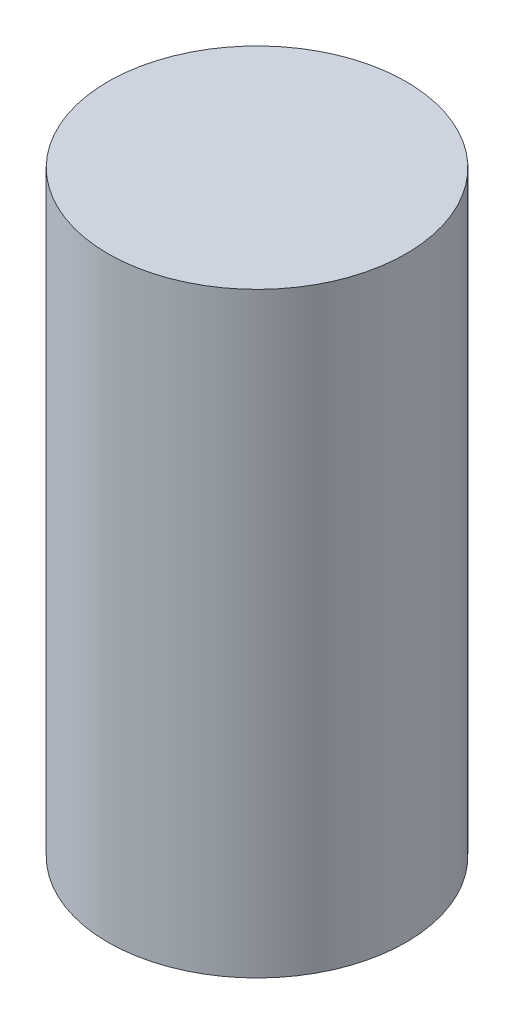
ISO-10303-21;
HEADER;
FILE_DESCRIPTION(('STEP AP214'),'2;1');
FILE_NAME('part.step','',(''),(''),'','','');
FILE_SCHEMA(('AUTOMOTIVE_DESIGN { 1 0 10303 214 1 1 1 1 }'));
ENDSEC;
DATA;
#1=APPLICATION_CONTEXT('core data for automotive mechanical design processes');
#2=APPLICATION_PROTOCOL_DEFINITION('international standard','automotive_design',2000,#1);
#3=PRODUCT_CONTEXT('',#1,'mechanical');
#4=PRODUCT('Part','Part','',(#3));
#5=PRODUCT_RELATED_PRODUCT_CATEGORY('part','',(#4));
#6=PRODUCT_DEFINITION_FORMATION('','',#4);
#7=PRODUCT_DEFINITION_CONTEXT('part definition',#1,'design');
#8=PRODUCT_DEFINITION('design','',#6,#7);
#9=PRODUCT_DEFINITION_SHAPE('','',#8);
#10=(LENGTH_UNIT() NAMED_UNIT(*) SI_UNIT(.MILLI.,.METRE.));
#11=(NAMED_UNIT(*) PLANE_ANGLE_UNIT() SI_UNIT($,.RADIAN.));
#12=(NAMED_UNIT(*) SI_UNIT($,.STERADIAN.) SOLID_ANGLE_UNIT());
#13=UNCERTAINTY_MEASURE_WITH_UNIT(LENGTH_MEASURE(1.E-05),#10,'distance_accuracy_value','');
#14=(GEOMETRIC_REPRESENTATION_CONTEXT(3) GLOBAL_UNCERTAINTY_ASSIGNED_CONTEXT((#13)) GLOBAL_UNIT_ASSIGNED_CONTEXT((#10,
#11,#12)) REPRESENTATION_CONTEXT('',''));
#15=CARTESIAN_POINT('',(0.,0.,0.));
#16=DIRECTION('',(0.,0.,1.));
#17=DIRECTION('',(1.,0.,0.));
#18=AXIS2_PLACEMENT_3D('',#15,#16,#17);
#19=CARTESIAN_POINT('',(0.,203.2,0.));
#20=DIRECTION('',(0.,-1.,0.));
#21=DIRECTION('',(0.,0.,-1.));
#22=AXIS2_PLACEMENT_3D('',#19,#20,#21);
#23=CYLINDRICAL_SURFACE('',#22,50.8);
#24=CARTESIAN_POINT('',(0.,203.2,0.));
#25=DIRECTION('',(0.,1.,0.));
#26=DIRECTION('',(0.,0.,1.));
#27=AXIS2_PLACEMENT_3D('',#24,#25,#26);
#28=CIRCLE('',#27,50.8);
#29=CARTESIAN_POINT('',(0.,203.2,50.8));
#30=VERTEX_POINT('',#29);
#31=EDGE_CURVE('E10',#30,#30,#28,.T.);
#32=ORIENTED_EDGE('',*,*,#31,.F.);
#33=EDGE_LOOP('',(#32));
#34=FACE_BOUND('',#33,.T.);
#35=CARTESIAN_POINT('',(0.,0.,0.));
#36=DIRECTION('',(0.,1.,0.));
#37=DIRECTION('',(0.,0.,1.));
#38=AXIS2_PLACEMENT_3D('',#35,#36,#37);
#39=CIRCLE('',#38,50.8);
#40=CARTESIAN_POINT('',(0.,0.,50.8));
#41=VERTEX_POINT('',#40);
#42=EDGE_CURVE('E37',#41,#41,#39,.T.);
#43=ORIENTED_EDGE('',*,*,#42,.T.);
#44=EDGE_LOOP('',(#43));
#45=FACE_BOUND('',#44,.T.);
#46=ADVANCED_FACE('F34',(#34,#45),#23,.T.);
#47=CARTESIAN_POINT('',(0.,203.2,0.));
#48=DIRECTION('',(0.,1.,0.));
#49=DIRECTION('',(0.,0.,1.));
#50=AXIS2_PLACEMENT_3D('',#47,#48,#49);
#51=PLANE('',#50);
#52=ORIENTED_EDGE('',*,*,#31,.T.);
#53=EDGE_LOOP('',(#52));
#54=FACE_BOUND('',#53,.T.);
#55=ADVANCED_FACE('F49',(#54),#51,.T.);
#56=CARTESIAN_POINT('',(0.,0.,0.));
#57=DIRECTION('',(0.,1.,0.));
#58=DIRECTION('',(0.,0.,1.));
#59=AXIS2_PLACEMENT_3D('',#56,#57,#58);
#60=PLANE('',#59);
#61=ORIENTED_EDGE('',*,*,#42,.F.);
#62=EDGE_LOOP('',(#61));
#63=FACE_BOUND('',#62,.T.);
#64=ADVANCED_FACE('F47',(#63),#60,.F.);
#65=CLOSED_SHELL('',(#46,#55,#64));
#66=MANIFOLD_SOLID_BREP('B2',#65);
#67=ADVANCED_BREP_SHAPE_REPRESENTATION('',(#18,#66),#14);
#68=SHAPE_DEFINITION_REPRESENTATION(#9,#67);
ENDSEC;
END-ISO-10303-21;
